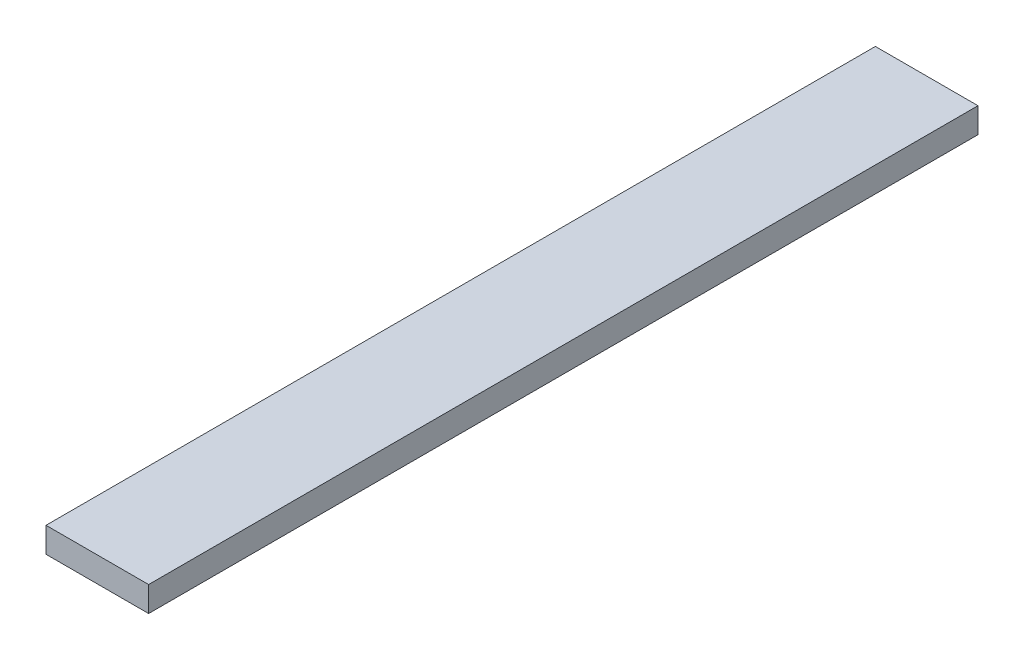
ISO-10303-21;
HEADER;
FILE_DESCRIPTION(('STEP AP214'),'2;1');
FILE_NAME('part.step','',(''),(''),'','','');
FILE_SCHEMA(('AUTOMOTIVE_DESIGN { 1 0 10303 214 1 1 1 1 }'));
ENDSEC;
DATA;
#1=APPLICATION_CONTEXT('core data for automotive mechanical design processes');
#2=APPLICATION_PROTOCOL_DEFINITION('international standard','automotive_design',2000,#1);
#3=PRODUCT_CONTEXT('',#1,'mechanical');
#4=PRODUCT('Part','Part','',(#3));
#5=PRODUCT_RELATED_PRODUCT_CATEGORY('part','',(#4));
#6=PRODUCT_DEFINITION_FORMATION('','',#4);
#7=PRODUCT_DEFINITION_CONTEXT('part definition',#1,'design');
#8=PRODUCT_DEFINITION('design','',#6,#7);
#9=PRODUCT_DEFINITION_SHAPE('','',#8);
#10=(LENGTH_UNIT() NAMED_UNIT(*) SI_UNIT(.MILLI.,.METRE.));
#11=(NAMED_UNIT(*) PLANE_ANGLE_UNIT() SI_UNIT($,.RADIAN.));
#12=(NAMED_UNIT(*) SI_UNIT($,.STERADIAN.) SOLID_ANGLE_UNIT());
#13=UNCERTAINTY_MEASURE_WITH_UNIT(LENGTH_MEASURE(1.E-05),#10,'distance_accuracy_value','');
#14=(GEOMETRIC_REPRESENTATION_CONTEXT(3) GLOBAL_UNCERTAINTY_ASSIGNED_CONTEXT((#13)) GLOBAL_UNIT_ASSIGNED_CONTEXT((#10,
#11,#12)) REPRESENTATION_CONTEXT('',''));
#15=CARTESIAN_POINT('',(0.,0.,0.));
#16=DIRECTION('',(0.,0.,1.));
#17=DIRECTION('',(1.,0.,0.));
#18=AXIS2_PLACEMENT_3D('',#15,#16,#17);
#19=CARTESIAN_POINT('',(-57.0652173913044,6.,-166.478260869565));
#20=DIRECTION('',(1.,0.,0.));
#21=DIRECTION('',(0.,0.,-1.));
#22=AXIS2_PLACEMENT_3D('',#19,#20,#21);
#23=PLANE('',#22);
#24=DIRECTION('',(0.,0.,1.));
#25=VECTOR('',#24,1.);
#26=CARTESIAN_POINT('',(-57.0652173913044,0.,-166.478260869565));
#27=LINE('',#26,#25);
#28=CARTESIAN_POINT('',(-57.0652173913044,0.,-166.478260869565));
#29=VERTEX_POINT('',#28);
#30=CARTESIAN_POINT('',(-57.0652173913044,0.,31.5217391304348));
#31=VERTEX_POINT('',#30);
#32=EDGE_CURVE('E96',#29,#31,#27,.T.);
#33=ORIENTED_EDGE('',*,*,#32,.T.);
#34=DIRECTION('',(0.,-1.,0.));
#35=VECTOR('',#34,1.);
#36=CARTESIAN_POINT('',(-57.0652173913044,6.,31.5217391304348));
#37=LINE('',#36,#35);
#38=CARTESIAN_POINT('',(-57.0652173913044,6.,31.5217391304348));
#39=VERTEX_POINT('',#38);
#40=EDGE_CURVE('E11',#39,#31,#37,.T.);
#41=ORIENTED_EDGE('',*,*,#40,.F.);
#42=DIRECTION('',(0.,0.,1.));
#43=VECTOR('',#42,1.);
#44=CARTESIAN_POINT('',(-57.0652173913044,6.,-166.478260869565));
#45=LINE('',#44,#43);
#46=CARTESIAN_POINT('',(-57.0652173913044,6.,-166.478260869565));
#47=VERTEX_POINT('',#46);
#48=EDGE_CURVE('E84',#47,#39,#45,.T.);
#49=ORIENTED_EDGE('',*,*,#48,.F.);
#50=DIRECTION('',(0.,-1.,0.));
#51=VECTOR('',#50,1.);
#52=CARTESIAN_POINT('',(-57.0652173913044,6.,-166.478260869565));
#53=LINE('',#52,#51);
#54=EDGE_CURVE('E92',#47,#29,#53,.T.);
#55=ORIENTED_EDGE('',*,*,#54,.T.);
#56=EDGE_LOOP('',(#33,#41,#49,#55));
#57=FACE_BOUND('',#56,.T.);
#58=ADVANCED_FACE('F33',(#57),#23,.F.);
#59=CARTESIAN_POINT('',(-57.0652173913044,6.,31.5217391304348));
#60=DIRECTION('',(0.,0.,-1.));
#61=DIRECTION('',(-1.,0.,0.));
#62=AXIS2_PLACEMENT_3D('',#59,#60,#61);
#63=PLANE('',#62);
#64=DIRECTION('',(1.,0.,0.));
#65=VECTOR('',#64,1.);
#66=CARTESIAN_POINT('',(-57.0652173913044,0.,31.5217391304348));
#67=LINE('',#66,#65);
#68=CARTESIAN_POINT('',(-32.5652173913044,0.,31.5217391304348));
#69=VERTEX_POINT('',#68);
#70=EDGE_CURVE('E88',#31,#69,#67,.T.);
#71=ORIENTED_EDGE('',*,*,#70,.T.);
#72=DIRECTION('',(0.,-1.,0.));
#73=VECTOR('',#72,1.);
#74=CARTESIAN_POINT('',(-32.5652173913044,6.,31.5217391304348));
#75=LINE('',#74,#73);
#76=CARTESIAN_POINT('',(-32.5652173913044,6.,31.5217391304348));
#77=VERTEX_POINT('',#76);
#78=EDGE_CURVE('E41',#77,#69,#75,.T.);
#79=ORIENTED_EDGE('',*,*,#78,.F.);
#80=DIRECTION('',(1.,0.,0.));
#81=VECTOR('',#80,1.);
#82=CARTESIAN_POINT('',(-57.0652173913044,6.,31.5217391304348));
#83=LINE('',#82,#81);
#84=EDGE_CURVE('E79',#39,#77,#83,.T.);
#85=ORIENTED_EDGE('',*,*,#84,.F.);
#86=ORIENTED_EDGE('',*,*,#40,.T.);
#87=EDGE_LOOP('',(#71,#79,#85,#86));
#88=FACE_BOUND('',#87,.T.);
#89=ADVANCED_FACE('F87',(#88),#63,.F.);
#90=CARTESIAN_POINT('',(-32.5652173913044,6.,-166.478260869565));
#91=DIRECTION('',(-1.,0.,0.));
#92=DIRECTION('',(0.,0.,1.));
#93=AXIS2_PLACEMENT_3D('',#90,#91,#92);
#94=PLANE('',#93);
#95=DIRECTION('',(0.,0.,-1.));
#96=VECTOR('',#95,1.);
#97=CARTESIAN_POINT('',(-32.5652173913044,0.,-166.478260869565));
#98=LINE('',#97,#96);
#99=CARTESIAN_POINT('',(-32.5652173913044,0.,-166.478260869565));
#100=VERTEX_POINT('',#99);
#101=EDGE_CURVE('E66',#69,#100,#98,.T.);
#102=ORIENTED_EDGE('',*,*,#101,.T.);
#103=DIRECTION('',(0.,-1.,0.));
#104=VECTOR('',#103,1.);
#105=CARTESIAN_POINT('',(-32.5652173913044,6.,-166.478260869565));
#106=LINE('',#105,#104);
#107=CARTESIAN_POINT('',(-32.5652173913044,6.,-166.478260869565));
#108=VERTEX_POINT('',#107);
#109=EDGE_CURVE('E89',#108,#100,#106,.T.);
#110=ORIENTED_EDGE('',*,*,#109,.F.);
#111=DIRECTION('',(0.,0.,-1.));
#112=VECTOR('',#111,1.);
#113=CARTESIAN_POINT('',(-32.5652173913044,6.,-166.478260869565));
#114=LINE('',#113,#112);
#115=EDGE_CURVE('E82',#77,#108,#114,.T.);
#116=ORIENTED_EDGE('',*,*,#115,.F.);
#117=ORIENTED_EDGE('',*,*,#78,.T.);
#118=EDGE_LOOP('',(#102,#110,#116,#117));
#119=FACE_BOUND('',#118,.T.);
#120=ADVANCED_FACE('F90',(#119),#94,.F.);
#121=CARTESIAN_POINT('',(-57.0652173913044,6.,-166.478260869565));
#122=DIRECTION('',(0.,0.,1.));
#123=DIRECTION('',(1.,0.,0.));
#124=AXIS2_PLACEMENT_3D('',#121,#122,#123);
#125=PLANE('',#124);
#126=DIRECTION('',(-1.,0.,0.));
#127=VECTOR('',#126,1.);
#128=CARTESIAN_POINT('',(-57.0652173913044,0.,-166.478260869565));
#129=LINE('',#128,#127);
#130=EDGE_CURVE('E72',#100,#29,#129,.T.);
#131=ORIENTED_EDGE('',*,*,#130,.T.);
#132=ORIENTED_EDGE('',*,*,#54,.F.);
#133=DIRECTION('',(-1.,0.,0.));
#134=VECTOR('',#133,1.);
#135=CARTESIAN_POINT('',(-57.0652173913044,6.,-166.478260869565));
#136=LINE('',#135,#134);
#137=EDGE_CURVE('E49',#108,#47,#136,.T.);
#138=ORIENTED_EDGE('',*,*,#137,.F.);
#139=ORIENTED_EDGE('',*,*,#109,.T.);
#140=EDGE_LOOP('',(#131,#132,#138,#139));
#141=FACE_BOUND('',#140,.T.);
#142=ADVANCED_FACE('F103',(#141),#125,.F.);
#143=CARTESIAN_POINT('',(0.,6.,0.));
#144=DIRECTION('',(0.,1.,0.));
#145=DIRECTION('',(0.,0.,1.));
#146=AXIS2_PLACEMENT_3D('',#143,#144,#145);
#147=PLANE('',#146);
#148=ORIENTED_EDGE('',*,*,#48,.T.);
#149=ORIENTED_EDGE('',*,*,#84,.T.);
#150=ORIENTED_EDGE('',*,*,#115,.T.);
#151=ORIENTED_EDGE('',*,*,#137,.T.);
#152=EDGE_LOOP('',(#148,#149,#150,#151));
#153=FACE_BOUND('',#152,.T.);
#154=ADVANCED_FACE('F80',(#153),#147,.T.);
#155=CARTESIAN_POINT('',(0.,0.,0.));
#156=DIRECTION('',(0.,1.,0.));
#157=DIRECTION('',(0.,0.,1.));
#158=AXIS2_PLACEMENT_3D('',#155,#156,#157);
#159=PLANE('',#158);
#160=ORIENTED_EDGE('',*,*,#32,.F.);
#161=ORIENTED_EDGE('',*,*,#130,.F.);
#162=ORIENTED_EDGE('',*,*,#101,.F.);
#163=ORIENTED_EDGE('',*,*,#70,.F.);
#164=EDGE_LOOP('',(#160,#161,#162,#163));
#165=FACE_BOUND('',#164,.T.);
#166=ADVANCED_FACE('F106',(#165),#159,.F.);
#167=CLOSED_SHELL('',(#58,#89,#120,#142,#154,#166));
#168=MANIFOLD_SOLID_BREP('B2',#167);
#169=ADVANCED_BREP_SHAPE_REPRESENTATION('',(#18,#168),#14);
#170=SHAPE_DEFINITION_REPRESENTATION(#9,#169);
ENDSEC;
END-ISO-10303-21;
